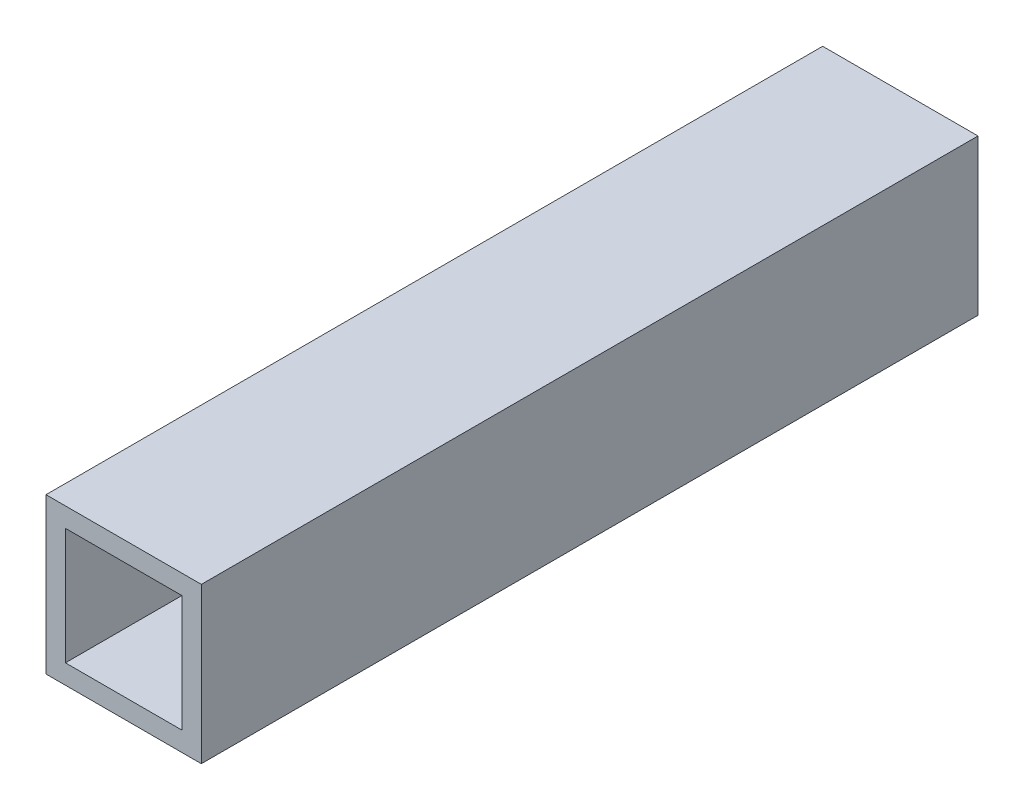
ISO-10303-21;
HEADER;
FILE_DESCRIPTION(('STEP AP214'),'2;1');
FILE_NAME('part.step','',(''),(''),'','','');
FILE_SCHEMA(('AUTOMOTIVE_DESIGN { 1 0 10303 214 1 1 1 1 }'));
ENDSEC;
DATA;
#1=APPLICATION_CONTEXT('core data for automotive mechanical design processes');
#2=APPLICATION_PROTOCOL_DEFINITION('international standard','automotive_design',2000,#1);
#3=PRODUCT_CONTEXT('',#1,'mechanical');
#4=PRODUCT('Part','Part','',(#3));
#5=PRODUCT_RELATED_PRODUCT_CATEGORY('part','',(#4));
#6=PRODUCT_DEFINITION_FORMATION('','',#4);
#7=PRODUCT_DEFINITION_CONTEXT('part definition',#1,'design');
#8=PRODUCT_DEFINITION('design','',#6,#7);
#9=PRODUCT_DEFINITION_SHAPE('','',#8);
#10=(LENGTH_UNIT() NAMED_UNIT(*) SI_UNIT(.MILLI.,.METRE.));
#11=(NAMED_UNIT(*) PLANE_ANGLE_UNIT() SI_UNIT($,.RADIAN.));
#12=(NAMED_UNIT(*) SI_UNIT($,.STERADIAN.) SOLID_ANGLE_UNIT());
#13=UNCERTAINTY_MEASURE_WITH_UNIT(LENGTH_MEASURE(1.E-05),#10,'distance_accuracy_value','');
#14=(GEOMETRIC_REPRESENTATION_CONTEXT(3) GLOBAL_UNCERTAINTY_ASSIGNED_CONTEXT((#13)) GLOBAL_UNIT_ASSIGNED_CONTEXT((#10,
#11,#12)) REPRESENTATION_CONTEXT('',''));
#15=CARTESIAN_POINT('',(0.,0.,0.));
#16=DIRECTION('',(0.,0.,1.));
#17=DIRECTION('',(1.,0.,0.));
#18=AXIS2_PLACEMENT_3D('',#15,#16,#17);
#19=CARTESIAN_POINT('',(0.,0.,63.5));
#20=DIRECTION('',(0.,0.,-1.));
#21=DIRECTION('',(-1.,0.,0.));
#22=AXIS2_PLACEMENT_3D('',#19,#20,#21);
#23=PLANE('',#22);
#24=DIRECTION('',(0.,1.,0.));
#25=VECTOR('',#24,1.);
#26=CARTESIAN_POINT('',(12.7,-12.7,63.5));
#27=LINE('',#26,#25);
#28=CARTESIAN_POINT('',(12.7,-12.7,63.5));
#29=VERTEX_POINT('',#28);
#30=CARTESIAN_POINT('',(12.7,12.7,63.5));
#31=VERTEX_POINT('',#30);
#32=EDGE_CURVE('E130',#29,#31,#27,.T.);
#33=ORIENTED_EDGE('',*,*,#32,.T.);
#34=DIRECTION('',(-1.,0.,0.));
#35=VECTOR('',#34,1.);
#36=CARTESIAN_POINT('',(-12.7,12.7,63.5));
#37=LINE('',#36,#35);
#38=CARTESIAN_POINT('',(-12.7,12.7,63.5));
#39=VERTEX_POINT('',#38);
#40=EDGE_CURVE('E133',#31,#39,#37,.T.);
#41=ORIENTED_EDGE('',*,*,#40,.T.);
#42=DIRECTION('',(0.,-1.,0.));
#43=VECTOR('',#42,1.);
#44=CARTESIAN_POINT('',(-12.7,-12.7,63.5));
#45=LINE('',#44,#43);
#46=CARTESIAN_POINT('',(-12.7,-12.7,63.5));
#47=VERTEX_POINT('',#46);
#48=EDGE_CURVE('E136',#39,#47,#45,.T.);
#49=ORIENTED_EDGE('',*,*,#48,.T.);
#50=DIRECTION('',(1.,0.,0.));
#51=VECTOR('',#50,1.);
#52=CARTESIAN_POINT('',(-12.7,-12.7,63.5));
#53=LINE('',#52,#51);
#54=EDGE_CURVE('E138',#47,#29,#53,.T.);
#55=ORIENTED_EDGE('',*,*,#54,.T.);
#56=EDGE_LOOP('',(#33,#41,#49,#55));
#57=FACE_BOUND('',#56,.T.);
#58=DIRECTION('',(0.,1.,0.));
#59=VECTOR('',#58,1.);
#60=CARTESIAN_POINT('',(9.525,0.,63.5));
#61=LINE('',#60,#59);
#62=CARTESIAN_POINT('',(9.525,-9.525,63.5));
#63=VERTEX_POINT('',#62);
#64=CARTESIAN_POINT('',(9.525,9.525,63.5));
#65=VERTEX_POINT('',#64);
#66=EDGE_CURVE('E118',#63,#65,#61,.T.);
#67=ORIENTED_EDGE('',*,*,#66,.F.);
#68=DIRECTION('',(1.,0.,0.));
#69=VECTOR('',#68,1.);
#70=CARTESIAN_POINT('',(0.,-9.525,63.5));
#71=LINE('',#70,#69);
#72=CARTESIAN_POINT('',(-9.525,-9.525,63.5));
#73=VERTEX_POINT('',#72);
#74=EDGE_CURVE('E103',#73,#63,#71,.T.);
#75=ORIENTED_EDGE('',*,*,#74,.F.);
#76=DIRECTION('',(0.,-1.,0.));
#77=VECTOR('',#76,1.);
#78=CARTESIAN_POINT('',(-9.525,0.,63.5));
#79=LINE('',#78,#77);
#80=CARTESIAN_POINT('',(-9.525,9.525,63.5));
#81=VERTEX_POINT('',#80);
#82=EDGE_CURVE('E127',#81,#73,#79,.T.);
#83=ORIENTED_EDGE('',*,*,#82,.F.);
#84=DIRECTION('',(-1.,0.,0.));
#85=VECTOR('',#84,1.);
#86=CARTESIAN_POINT('',(0.,9.525,63.5));
#87=LINE('',#86,#85);
#88=EDGE_CURVE('E120',#65,#81,#87,.T.);
#89=ORIENTED_EDGE('',*,*,#88,.F.);
#90=EDGE_LOOP('',(#67,#75,#83,#89));
#91=FACE_BOUND('',#90,.T.);
#92=ADVANCED_FACE('F33',(#57,#91),#23,.F.);
#93=CARTESIAN_POINT('',(0.,0.,-63.5));
#94=DIRECTION('',(0.,0.,-1.));
#95=DIRECTION('',(-1.,0.,0.));
#96=AXIS2_PLACEMENT_3D('',#93,#94,#95);
#97=PLANE('',#96);
#98=DIRECTION('',(0.,1.,0.));
#99=VECTOR('',#98,1.);
#100=CARTESIAN_POINT('',(12.7,-12.7,-63.5));
#101=LINE('',#100,#99);
#102=CARTESIAN_POINT('',(12.7,-12.7,-63.5));
#103=VERTEX_POINT('',#102);
#104=CARTESIAN_POINT('',(12.7,12.7,-63.5));
#105=VERTEX_POINT('',#104);
#106=EDGE_CURVE('E141',#103,#105,#101,.T.);
#107=ORIENTED_EDGE('',*,*,#106,.F.);
#108=DIRECTION('',(1.,0.,0.));
#109=VECTOR('',#108,1.);
#110=CARTESIAN_POINT('',(-12.7,-12.7,-63.5));
#111=LINE('',#110,#109);
#112=CARTESIAN_POINT('',(-12.7,-12.7,-63.5));
#113=VERTEX_POINT('',#112);
#114=EDGE_CURVE('E134',#113,#103,#111,.T.);
#115=ORIENTED_EDGE('',*,*,#114,.F.);
#116=DIRECTION('',(0.,-1.,0.));
#117=VECTOR('',#116,1.);
#118=CARTESIAN_POINT('',(-12.7,-12.7,-63.5));
#119=LINE('',#118,#117);
#120=CARTESIAN_POINT('',(-12.7,12.7,-63.5));
#121=VERTEX_POINT('',#120);
#122=EDGE_CURVE('E146',#121,#113,#119,.T.);
#123=ORIENTED_EDGE('',*,*,#122,.F.);
#124=DIRECTION('',(-1.,0.,0.));
#125=VECTOR('',#124,1.);
#126=CARTESIAN_POINT('',(-12.7,12.7,-63.5));
#127=LINE('',#126,#125);
#128=EDGE_CURVE('E144',#105,#121,#127,.T.);
#129=ORIENTED_EDGE('',*,*,#128,.F.);
#130=EDGE_LOOP('',(#107,#115,#123,#129));
#131=FACE_BOUND('',#130,.T.);
#132=DIRECTION('',(1.,0.,0.));
#133=VECTOR('',#132,1.);
#134=CARTESIAN_POINT('',(0.,-9.525,-63.5));
#135=LINE('',#134,#133);
#136=CARTESIAN_POINT('',(-9.525,-9.525,-63.5));
#137=VERTEX_POINT('',#136);
#138=CARTESIAN_POINT('',(9.525,-9.525,-63.5));
#139=VERTEX_POINT('',#138);
#140=EDGE_CURVE('E101',#137,#139,#135,.T.);
#141=ORIENTED_EDGE('',*,*,#140,.T.);
#142=DIRECTION('',(0.,1.,0.));
#143=VECTOR('',#142,1.);
#144=CARTESIAN_POINT('',(9.525,0.,-63.5));
#145=LINE('',#144,#143);
#146=CARTESIAN_POINT('',(9.525,9.525,-63.5));
#147=VERTEX_POINT('',#146);
#148=EDGE_CURVE('E109',#139,#147,#145,.T.);
#149=ORIENTED_EDGE('',*,*,#148,.T.);
#150=DIRECTION('',(-1.,0.,0.));
#151=VECTOR('',#150,1.);
#152=CARTESIAN_POINT('',(0.,9.525,-63.5));
#153=LINE('',#152,#151);
#154=CARTESIAN_POINT('',(-9.525,9.525,-63.5));
#155=VERTEX_POINT('',#154);
#156=EDGE_CURVE('E115',#147,#155,#153,.T.);
#157=ORIENTED_EDGE('',*,*,#156,.T.);
#158=DIRECTION('',(0.,-1.,0.));
#159=VECTOR('',#158,1.);
#160=CARTESIAN_POINT('',(-9.525,0.,-63.5));
#161=LINE('',#160,#159);
#162=EDGE_CURVE('E55',#155,#137,#161,.T.);
#163=ORIENTED_EDGE('',*,*,#162,.T.);
#164=EDGE_LOOP('',(#141,#149,#157,#163));
#165=FACE_BOUND('',#164,.T.);
#166=ADVANCED_FACE('F117',(#131,#165),#97,.T.);
#167=CARTESIAN_POINT('',(12.7,-12.7,63.5));
#168=DIRECTION('',(-1.,0.,0.));
#169=DIRECTION('',(0.,0.,1.));
#170=AXIS2_PLACEMENT_3D('',#167,#168,#169);
#171=PLANE('',#170);
#172=ORIENTED_EDGE('',*,*,#106,.T.);
#173=DIRECTION('',(0.,0.,-1.));
#174=VECTOR('',#173,1.);
#175=CARTESIAN_POINT('',(12.7,12.7,63.5));
#176=LINE('',#175,#174);
#177=EDGE_CURVE('E11',#31,#105,#176,.T.);
#178=ORIENTED_EDGE('',*,*,#177,.F.);
#179=ORIENTED_EDGE('',*,*,#32,.F.);
#180=DIRECTION('',(0.,0.,-1.));
#181=VECTOR('',#180,1.);
#182=CARTESIAN_POINT('',(12.7,-12.7,63.5));
#183=LINE('',#182,#181);
#184=EDGE_CURVE('E140',#29,#103,#183,.T.);
#185=ORIENTED_EDGE('',*,*,#184,.T.);
#186=EDGE_LOOP('',(#172,#178,#179,#185));
#187=FACE_BOUND('',#186,.T.);
#188=ADVANCED_FACE('F35',(#187),#171,.F.);
#189=CARTESIAN_POINT('',(-12.7,12.7,63.5));
#190=DIRECTION('',(0.,-1.,0.));
#191=DIRECTION('',(0.,0.,-1.));
#192=AXIS2_PLACEMENT_3D('',#189,#190,#191);
#193=PLANE('',#192);
#194=ORIENTED_EDGE('',*,*,#128,.T.);
#195=DIRECTION('',(0.,0.,-1.));
#196=VECTOR('',#195,1.);
#197=CARTESIAN_POINT('',(-12.7,12.7,63.5));
#198=LINE('',#197,#196);
#199=EDGE_CURVE('E41',#39,#121,#198,.T.);
#200=ORIENTED_EDGE('',*,*,#199,.F.);
#201=ORIENTED_EDGE('',*,*,#40,.F.);
#202=ORIENTED_EDGE('',*,*,#177,.T.);
#203=EDGE_LOOP('',(#194,#200,#201,#202));
#204=FACE_BOUND('',#203,.T.);
#205=ADVANCED_FACE('F173',(#204),#193,.F.);
#206=CARTESIAN_POINT('',(-12.7,-12.7,63.5));
#207=DIRECTION('',(1.,0.,0.));
#208=DIRECTION('',(0.,0.,-1.));
#209=AXIS2_PLACEMENT_3D('',#206,#207,#208);
#210=PLANE('',#209);
#211=ORIENTED_EDGE('',*,*,#122,.T.);
#212=DIRECTION('',(0.,0.,-1.));
#213=VECTOR('',#212,1.);
#214=CARTESIAN_POINT('',(-12.7,-12.7,63.5));
#215=LINE('',#214,#213);
#216=EDGE_CURVE('E151',#47,#113,#215,.T.);
#217=ORIENTED_EDGE('',*,*,#216,.F.);
#218=ORIENTED_EDGE('',*,*,#48,.F.);
#219=ORIENTED_EDGE('',*,*,#199,.T.);
#220=EDGE_LOOP('',(#211,#217,#218,#219));
#221=FACE_BOUND('',#220,.T.);
#222=ADVANCED_FACE('F158',(#221),#210,.F.);
#223=CARTESIAN_POINT('',(-12.7,-12.7,63.5));
#224=DIRECTION('',(0.,1.,0.));
#225=DIRECTION('',(0.,0.,1.));
#226=AXIS2_PLACEMENT_3D('',#223,#224,#225);
#227=PLANE('',#226);
#228=ORIENTED_EDGE('',*,*,#114,.T.);
#229=ORIENTED_EDGE('',*,*,#184,.F.);
#230=ORIENTED_EDGE('',*,*,#54,.F.);
#231=ORIENTED_EDGE('',*,*,#216,.T.);
#232=EDGE_LOOP('',(#228,#229,#230,#231));
#233=FACE_BOUND('',#232,.T.);
#234=ADVANCED_FACE('F166',(#233),#227,.F.);
#235=CARTESIAN_POINT('',(9.525,-12.7,63.5));
#236=DIRECTION('',(-1.,0.,0.));
#237=DIRECTION('',(0.,0.,1.));
#238=AXIS2_PLACEMENT_3D('',#235,#236,#237);
#239=PLANE('',#238);
#240=ORIENTED_EDGE('',*,*,#148,.F.);
#241=DIRECTION('',(0.,0.,-1.));
#242=VECTOR('',#241,1.);
#243=CARTESIAN_POINT('',(9.525,-9.525,63.5));
#244=LINE('',#243,#242);
#245=EDGE_CURVE('E97',#63,#139,#244,.T.);
#246=ORIENTED_EDGE('',*,*,#245,.F.);
#247=ORIENTED_EDGE('',*,*,#66,.T.);
#248=DIRECTION('',(0.,0.,-1.));
#249=VECTOR('',#248,1.);
#250=CARTESIAN_POINT('',(9.525,9.525,63.5));
#251=LINE('',#250,#249);
#252=EDGE_CURVE('E112',#65,#147,#251,.T.);
#253=ORIENTED_EDGE('',*,*,#252,.T.);
#254=EDGE_LOOP('',(#240,#246,#247,#253));
#255=FACE_BOUND('',#254,.T.);
#256=ADVANCED_FACE('F110',(#255),#239,.T.);
#257=CARTESIAN_POINT('',(-12.7,9.525,63.5));
#258=DIRECTION('',(0.,-1.,0.));
#259=DIRECTION('',(0.,0.,-1.));
#260=AXIS2_PLACEMENT_3D('',#257,#258,#259);
#261=PLANE('',#260);
#262=ORIENTED_EDGE('',*,*,#156,.F.);
#263=ORIENTED_EDGE('',*,*,#252,.F.);
#264=ORIENTED_EDGE('',*,*,#88,.T.);
#265=DIRECTION('',(0.,0.,-1.));
#266=VECTOR('',#265,1.);
#267=CARTESIAN_POINT('',(-9.525,9.525,63.5));
#268=LINE('',#267,#266);
#269=EDGE_CURVE('E256',#81,#155,#268,.T.);
#270=ORIENTED_EDGE('',*,*,#269,.T.);
#271=EDGE_LOOP('',(#262,#263,#264,#270));
#272=FACE_BOUND('',#271,.T.);
#273=ADVANCED_FACE('F193',(#272),#261,.T.);
#274=CARTESIAN_POINT('',(-9.525,-12.7,63.5));
#275=DIRECTION('',(1.,0.,0.));
#276=DIRECTION('',(0.,0.,-1.));
#277=AXIS2_PLACEMENT_3D('',#274,#275,#276);
#278=PLANE('',#277);
#279=ORIENTED_EDGE('',*,*,#162,.F.);
#280=ORIENTED_EDGE('',*,*,#269,.F.);
#281=ORIENTED_EDGE('',*,*,#82,.T.);
#282=DIRECTION('',(0.,0.,-1.));
#283=VECTOR('',#282,1.);
#284=CARTESIAN_POINT('',(-9.525,-9.525,63.5));
#285=LINE('',#284,#283);
#286=EDGE_CURVE('E48',#73,#137,#285,.T.);
#287=ORIENTED_EDGE('',*,*,#286,.T.);
#288=EDGE_LOOP('',(#279,#280,#281,#287));
#289=FACE_BOUND('',#288,.T.);
#290=ADVANCED_FACE('F198',(#289),#278,.T.);
#291=CARTESIAN_POINT('',(-12.7,-9.525,63.5));
#292=DIRECTION('',(0.,1.,0.));
#293=DIRECTION('',(0.,0.,1.));
#294=AXIS2_PLACEMENT_3D('',#291,#292,#293);
#295=PLANE('',#294);
#296=ORIENTED_EDGE('',*,*,#140,.F.);
#297=ORIENTED_EDGE('',*,*,#286,.F.);
#298=ORIENTED_EDGE('',*,*,#74,.T.);
#299=ORIENTED_EDGE('',*,*,#245,.T.);
#300=EDGE_LOOP('',(#296,#297,#298,#299));
#301=FACE_BOUND('',#300,.T.);
#302=ADVANCED_FACE('F99',(#301),#295,.T.);
#303=CLOSED_SHELL('',(#92,#166,#188,#205,#222,#234,#256,#273,#290,#302));
#304=MANIFOLD_SOLID_BREP('B2',#303);
#305=ADVANCED_BREP_SHAPE_REPRESENTATION('',(#18,#304),#14);
#306=SHAPE_DEFINITION_REPRESENTATION(#9,#305);
ENDSEC;
END-ISO-10303-21;
